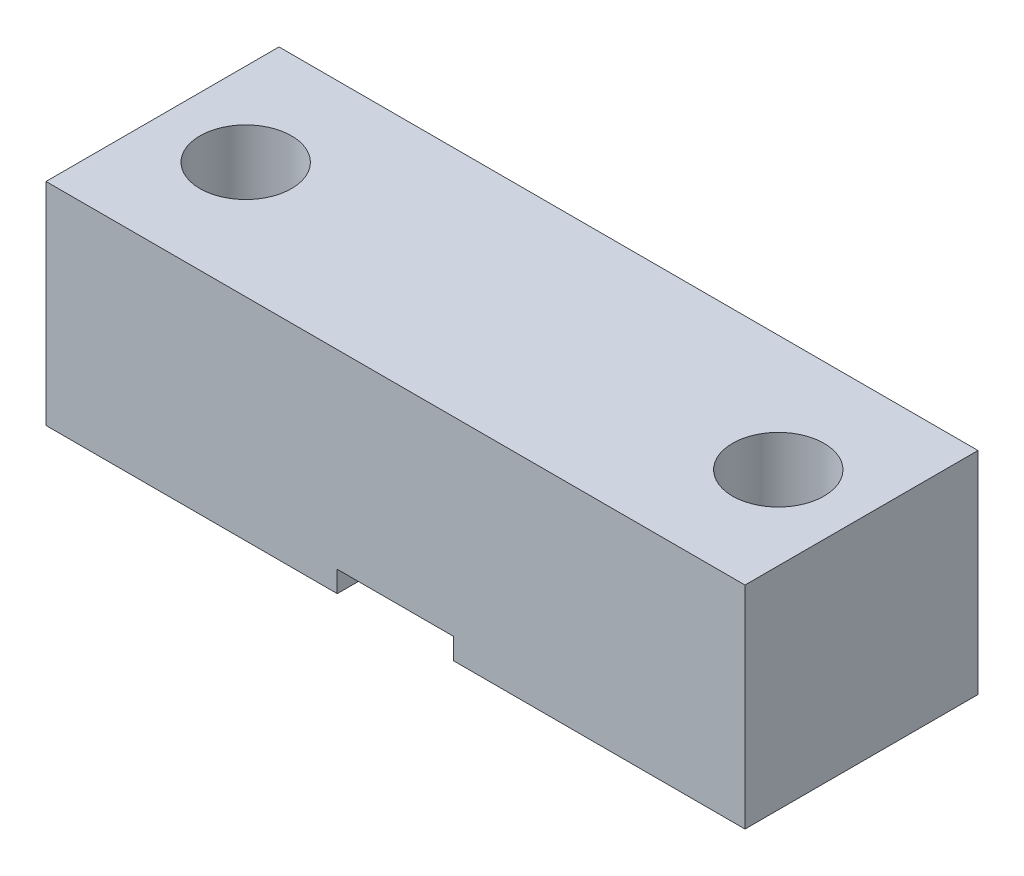
ISO-10303-21;
HEADER;
FILE_DESCRIPTION(('STEP AP214'),'2;1');
FILE_NAME('part.step','',(''),(''),'','','');
FILE_SCHEMA(('AUTOMOTIVE_DESIGN { 1 0 10303 214 1 1 1 1 }'));
ENDSEC;
DATA;
#1=APPLICATION_CONTEXT('core data for automotive mechanical design processes');
#2=APPLICATION_PROTOCOL_DEFINITION('international standard','automotive_design',2000,#1);
#3=PRODUCT_CONTEXT('',#1,'mechanical');
#4=PRODUCT('Part','Part','',(#3));
#5=PRODUCT_RELATED_PRODUCT_CATEGORY('part','',(#4));
#6=PRODUCT_DEFINITION_FORMATION('','',#4);
#7=PRODUCT_DEFINITION_CONTEXT('part definition',#1,'design');
#8=PRODUCT_DEFINITION('design','',#6,#7);
#9=PRODUCT_DEFINITION_SHAPE('','',#8);
#10=(LENGTH_UNIT() NAMED_UNIT(*) SI_UNIT(.MILLI.,.METRE.));
#11=(NAMED_UNIT(*) PLANE_ANGLE_UNIT() SI_UNIT($,.RADIAN.));
#12=(NAMED_UNIT(*) SI_UNIT($,.STERADIAN.) SOLID_ANGLE_UNIT());
#13=UNCERTAINTY_MEASURE_WITH_UNIT(LENGTH_MEASURE(1.E-05),#10,'distance_accuracy_value','');
#14=(GEOMETRIC_REPRESENTATION_CONTEXT(3) GLOBAL_UNCERTAINTY_ASSIGNED_CONTEXT((#13)) GLOBAL_UNIT_ASSIGNED_CONTEXT((#10,
#11,#12)) REPRESENTATION_CONTEXT('',''));
#15=CARTESIAN_POINT('',(0.,0.,0.));
#16=DIRECTION('',(0.,0.,1.));
#17=DIRECTION('',(1.,0.,0.));
#18=AXIS2_PLACEMENT_3D('',#15,#16,#17);
#19=CARTESIAN_POINT('',(0.,0.,0.));
#20=DIRECTION('',(0.,1.,0.));
#21=DIRECTION('',(0.,0.,1.));
#22=AXIS2_PLACEMENT_3D('',#19,#20,#21);
#23=PLANE('',#22);
#24=CARTESIAN_POINT('',(-16.,0.,0.));
#25=DIRECTION('',(0.,1.,0.));
#26=DIRECTION('',(0.,0.,1.));
#27=AXIS2_PLACEMENT_3D('',#24,#25,#26);
#28=CIRCLE('',#27,2.75);
#29=CARTESIAN_POINT('',(-16.,0.,2.75));
#30=VERTEX_POINT('',#29);
#31=EDGE_CURVE('E165',#30,#30,#28,.T.);
#32=ORIENTED_EDGE('',*,*,#31,.T.);
#33=EDGE_LOOP('',(#32));
#34=FACE_BOUND('',#33,.T.);
#35=DIRECTION('',(-1.,0.,0.));
#36=VECTOR('',#35,1.);
#37=CARTESIAN_POINT('',(-21.,0.,-7.00000000000001));
#38=LINE('',#37,#36);
#39=CARTESIAN_POINT('',(-3.5,0.,-7.00000000000001));
#40=VERTEX_POINT('',#39);
#41=CARTESIAN_POINT('',(-21.,0.,-7.00000000000001));
#42=VERTEX_POINT('',#41);
#43=EDGE_CURVE('E79',#40,#42,#38,.T.);
#44=ORIENTED_EDGE('',*,*,#43,.F.);
#45=DIRECTION('',(0.,0.,1.));
#46=VECTOR('',#45,1.);
#47=CARTESIAN_POINT('',(-3.5,0.,-14.1142743832383));
#48=LINE('',#47,#46);
#49=CARTESIAN_POINT('',(-3.5,0.,6.99999999999999));
#50=VERTEX_POINT('',#49);
#51=EDGE_CURVE('E110',#40,#50,#48,.T.);
#52=ORIENTED_EDGE('',*,*,#51,.T.);
#53=DIRECTION('',(1.,0.,0.));
#54=VECTOR('',#53,1.);
#55=CARTESIAN_POINT('',(-21.,0.,6.99999999999999));
#56=LINE('',#55,#54);
#57=CARTESIAN_POINT('',(-21.,0.,6.99999999999999));
#58=VERTEX_POINT('',#57);
#59=EDGE_CURVE('E120',#58,#50,#56,.T.);
#60=ORIENTED_EDGE('',*,*,#59,.F.);
#61=DIRECTION('',(0.,0.,1.));
#62=VECTOR('',#61,1.);
#63=CARTESIAN_POINT('',(-21.,0.,-7.00000000000001));
#64=LINE('',#63,#62);
#65=EDGE_CURVE('E131',#42,#58,#64,.T.);
#66=ORIENTED_EDGE('',*,*,#65,.F.);
#67=EDGE_LOOP('',(#44,#52,#60,#66));
#68=FACE_BOUND('',#67,.T.);
#69=ADVANCED_FACE('F34',(#34,#68),#23,.F.);
#70=CARTESIAN_POINT('',(0.,12.7,0.));
#71=DIRECTION('',(0.,1.,0.));
#72=DIRECTION('',(0.,0.,1.));
#73=AXIS2_PLACEMENT_3D('',#70,#71,#72);
#74=PLANE('',#73);
#75=CARTESIAN_POINT('',(-16.,12.7,0.));
#76=DIRECTION('',(0.,1.,0.));
#77=DIRECTION('',(0.,0.,1.));
#78=AXIS2_PLACEMENT_3D('',#75,#76,#77);
#79=CIRCLE('',#78,2.75);
#80=CARTESIAN_POINT('',(-16.,12.7,2.75));
#81=VERTEX_POINT('',#80);
#82=EDGE_CURVE('E168',#81,#81,#79,.T.);
#83=ORIENTED_EDGE('',*,*,#82,.F.);
#84=EDGE_LOOP('',(#83));
#85=FACE_BOUND('',#84,.T.);
#86=DIRECTION('',(0.,0.,1.));
#87=VECTOR('',#86,1.);
#88=CARTESIAN_POINT('',(-21.,12.7,-7.00000000000001));
#89=LINE('',#88,#87);
#90=CARTESIAN_POINT('',(-21.,12.7,-7.00000000000001));
#91=VERTEX_POINT('',#90);
#92=CARTESIAN_POINT('',(-21.,12.7,6.99999999999999));
#93=VERTEX_POINT('',#92);
#94=EDGE_CURVE('E138',#91,#93,#89,.T.);
#95=ORIENTED_EDGE('',*,*,#94,.T.);
#96=DIRECTION('',(1.,0.,0.));
#97=VECTOR('',#96,1.);
#98=CARTESIAN_POINT('',(-21.,12.7,6.99999999999999));
#99=LINE('',#98,#97);
#100=CARTESIAN_POINT('',(21.,12.7,6.99999999999999));
#101=VERTEX_POINT('',#100);
#102=EDGE_CURVE('E86',#93,#101,#99,.T.);
#103=ORIENTED_EDGE('',*,*,#102,.T.);
#104=DIRECTION('',(0.,0.,-1.));
#105=VECTOR('',#104,1.);
#106=CARTESIAN_POINT('',(21.,12.7,-7.00000000000001));
#107=LINE('',#106,#105);
#108=CARTESIAN_POINT('',(21.,12.7,-7.00000000000001));
#109=VERTEX_POINT('',#108);
#110=EDGE_CURVE('E149',#101,#109,#107,.T.);
#111=ORIENTED_EDGE('',*,*,#110,.T.);
#112=DIRECTION('',(-1.,0.,0.));
#113=VECTOR('',#112,1.);
#114=CARTESIAN_POINT('',(-21.,12.7,-7.00000000000001));
#115=LINE('',#114,#113);
#116=EDGE_CURVE('E58',#109,#91,#115,.T.);
#117=ORIENTED_EDGE('',*,*,#116,.T.);
#118=EDGE_LOOP('',(#95,#103,#111,#117));
#119=FACE_BOUND('',#118,.T.);
#120=CARTESIAN_POINT('',(16.,12.7,0.));
#121=DIRECTION('',(0.,1.,0.));
#122=DIRECTION('',(0.,0.,1.));
#123=AXIS2_PLACEMENT_3D('',#120,#121,#122);
#124=CIRCLE('',#123,2.75);
#125=CARTESIAN_POINT('',(16.,12.7,2.75));
#126=VERTEX_POINT('',#125);
#127=EDGE_CURVE('E169',#126,#126,#124,.T.);
#128=ORIENTED_EDGE('',*,*,#127,.F.);
#129=EDGE_LOOP('',(#128));
#130=FACE_BOUND('',#129,.T.);
#131=ADVANCED_FACE('F200',(#85,#119,#130),#74,.T.);
#132=CARTESIAN_POINT('',(3.5,0.,6.99999999999999));
#133=VERTEX_POINT('',#132);
#134=CARTESIAN_POINT('',(21.,0.,6.99999999999999));
#135=VERTEX_POINT('',#134);
#136=EDGE_CURVE('E128',#133,#135,#56,.T.);
#137=ORIENTED_EDGE('',*,*,#136,.F.);
#138=DIRECTION('',(0.,0.,1.));
#139=VECTOR('',#138,1.);
#140=CARTESIAN_POINT('',(3.5,0.,-14.1142743832383));
#141=LINE('',#140,#139);
#142=CARTESIAN_POINT('',(3.5,0.,-7.00000000000001));
#143=VERTEX_POINT('',#142);
#144=EDGE_CURVE('E121',#143,#133,#141,.T.);
#145=ORIENTED_EDGE('',*,*,#144,.F.);
#146=CARTESIAN_POINT('',(21.,0.,-7.00000000000001));
#147=VERTEX_POINT('',#146);
#148=EDGE_CURVE('E135',#147,#143,#38,.T.);
#149=ORIENTED_EDGE('',*,*,#148,.F.);
#150=DIRECTION('',(0.,0.,-1.));
#151=VECTOR('',#150,1.);
#152=CARTESIAN_POINT('',(21.,0.,-7.00000000000001));
#153=LINE('',#152,#151);
#154=EDGE_CURVE('E127',#135,#147,#153,.T.);
#155=ORIENTED_EDGE('',*,*,#154,.F.);
#156=EDGE_LOOP('',(#137,#145,#149,#155));
#157=FACE_BOUND('',#156,.T.);
#158=CARTESIAN_POINT('',(16.,0.,0.));
#159=DIRECTION('',(0.,1.,0.));
#160=DIRECTION('',(0.,0.,1.));
#161=AXIS2_PLACEMENT_3D('',#158,#159,#160);
#162=CIRCLE('',#161,2.75);
#163=CARTESIAN_POINT('',(16.,0.,2.75));
#164=VERTEX_POINT('',#163);
#165=EDGE_CURVE('E172',#164,#164,#162,.T.);
#166=ORIENTED_EDGE('',*,*,#165,.T.);
#167=EDGE_LOOP('',(#166));
#168=FACE_BOUND('',#167,.T.);
#169=ADVANCED_FACE('F153',(#157,#168),#23,.F.);
#170=CARTESIAN_POINT('',(-21.,12.7,-7.00000000000001));
#171=DIRECTION('',(1.,0.,0.));
#172=DIRECTION('',(0.,0.,-1.));
#173=AXIS2_PLACEMENT_3D('',#170,#171,#172);
#174=PLANE('',#173);
#175=ORIENTED_EDGE('',*,*,#65,.T.);
#176=DIRECTION('',(0.,-1.,0.));
#177=VECTOR('',#176,1.);
#178=CARTESIAN_POINT('',(-21.,12.7,6.99999999999999));
#179=LINE('',#178,#177);
#180=EDGE_CURVE('E11',#93,#58,#179,.T.);
#181=ORIENTED_EDGE('',*,*,#180,.F.);
#182=ORIENTED_EDGE('',*,*,#94,.F.);
#183=DIRECTION('',(0.,-1.,0.));
#184=VECTOR('',#183,1.);
#185=CARTESIAN_POINT('',(-21.,12.7,-7.00000000000001));
#186=LINE('',#185,#184);
#187=EDGE_CURVE('E139',#91,#42,#186,.T.);
#188=ORIENTED_EDGE('',*,*,#187,.T.);
#189=EDGE_LOOP('',(#175,#181,#182,#188));
#190=FACE_BOUND('',#189,.T.);
#191=ADVANCED_FACE('F36',(#190),#174,.F.);
#192=CARTESIAN_POINT('',(-21.,12.7,6.99999999999999));
#193=DIRECTION('',(0.,0.,-1.));
#194=DIRECTION('',(-1.,0.,0.));
#195=AXIS2_PLACEMENT_3D('',#192,#193,#194);
#196=PLANE('',#195);
#197=ORIENTED_EDGE('',*,*,#59,.T.);
#198=DIRECTION('',(0.,-1.,0.));
#199=VECTOR('',#198,1.);
#200=CARTESIAN_POINT('',(-3.5,1.27,6.99999999999999));
#201=LINE('',#200,#199);
#202=CARTESIAN_POINT('',(-3.5,1.27,6.99999999999999));
#203=VERTEX_POINT('',#202);
#204=EDGE_CURVE('E107',#203,#50,#201,.T.);
#205=ORIENTED_EDGE('',*,*,#204,.F.);
#206=DIRECTION('',(-1.,0.,0.));
#207=VECTOR('',#206,1.);
#208=CARTESIAN_POINT('',(-3.5,1.27,6.99999999999999));
#209=LINE('',#208,#207);
#210=CARTESIAN_POINT('',(3.5,1.27,6.99999999999999));
#211=VERTEX_POINT('',#210);
#212=EDGE_CURVE('E122',#211,#203,#209,.T.);
#213=ORIENTED_EDGE('',*,*,#212,.F.);
#214=DIRECTION('',(0.,1.,0.));
#215=VECTOR('',#214,1.);
#216=CARTESIAN_POINT('',(3.5,1.27,6.99999999999999));
#217=LINE('',#216,#215);
#218=EDGE_CURVE('E116',#133,#211,#217,.T.);
#219=ORIENTED_EDGE('',*,*,#218,.F.);
#220=ORIENTED_EDGE('',*,*,#136,.T.);
#221=DIRECTION('',(0.,-1.,0.));
#222=VECTOR('',#221,1.);
#223=CARTESIAN_POINT('',(21.,12.7,6.99999999999999));
#224=LINE('',#223,#222);
#225=EDGE_CURVE('E42',#101,#135,#224,.T.);
#226=ORIENTED_EDGE('',*,*,#225,.F.);
#227=ORIENTED_EDGE('',*,*,#102,.F.);
#228=ORIENTED_EDGE('',*,*,#180,.T.);
#229=EDGE_LOOP('',(#197,#205,#213,#219,#220,#226,#227,#228));
#230=FACE_BOUND('',#229,.T.);
#231=ADVANCED_FACE('F124',(#230),#196,.F.);
#232=CARTESIAN_POINT('',(21.,12.7,-7.00000000000001));
#233=DIRECTION('',(-1.,0.,0.));
#234=DIRECTION('',(0.,0.,1.));
#235=AXIS2_PLACEMENT_3D('',#232,#233,#234);
#236=PLANE('',#235);
#237=ORIENTED_EDGE('',*,*,#154,.T.);
#238=DIRECTION('',(0.,-1.,0.));
#239=VECTOR('',#238,1.);
#240=CARTESIAN_POINT('',(21.,12.7,-7.00000000000001));
#241=LINE('',#240,#239);
#242=EDGE_CURVE('E141',#109,#147,#241,.T.);
#243=ORIENTED_EDGE('',*,*,#242,.F.);
#244=ORIENTED_EDGE('',*,*,#110,.F.);
#245=ORIENTED_EDGE('',*,*,#225,.T.);
#246=EDGE_LOOP('',(#237,#243,#244,#245));
#247=FACE_BOUND('',#246,.T.);
#248=ADVANCED_FACE('F147',(#247),#236,.F.);
#249=CARTESIAN_POINT('',(-21.,12.7,-7.00000000000001));
#250=DIRECTION('',(0.,0.,1.));
#251=DIRECTION('',(1.,0.,0.));
#252=AXIS2_PLACEMENT_3D('',#249,#250,#251);
#253=PLANE('',#252);
#254=DIRECTION('',(1.,0.,0.));
#255=VECTOR('',#254,1.);
#256=CARTESIAN_POINT('',(-3.5,1.27,-7.00000000000001));
#257=LINE('',#256,#255);
#258=CARTESIAN_POINT('',(-3.5,1.27,-7.00000000000001));
#259=VERTEX_POINT('',#258);
#260=CARTESIAN_POINT('',(3.5,1.27,-7.00000000000001));
#261=VERTEX_POINT('',#260);
#262=EDGE_CURVE('E184',#259,#261,#257,.T.);
#263=ORIENTED_EDGE('',*,*,#262,.F.);
#264=DIRECTION('',(0.,1.,0.));
#265=VECTOR('',#264,1.);
#266=CARTESIAN_POINT('',(-3.5,1.27,-7.00000000000001));
#267=LINE('',#266,#265);
#268=EDGE_CURVE('E175',#40,#259,#267,.T.);
#269=ORIENTED_EDGE('',*,*,#268,.F.);
#270=ORIENTED_EDGE('',*,*,#43,.T.);
#271=ORIENTED_EDGE('',*,*,#187,.F.);
#272=ORIENTED_EDGE('',*,*,#116,.F.);
#273=ORIENTED_EDGE('',*,*,#242,.T.);
#274=ORIENTED_EDGE('',*,*,#148,.T.);
#275=DIRECTION('',(0.,-1.,0.));
#276=VECTOR('',#275,1.);
#277=CARTESIAN_POINT('',(3.5,1.27,-7.00000000000001));
#278=LINE('',#277,#276);
#279=EDGE_CURVE('E159',#261,#143,#278,.T.);
#280=ORIENTED_EDGE('',*,*,#279,.F.);
#281=EDGE_LOOP('',(#263,#269,#270,#271,#272,#273,#274,#280));
#282=FACE_BOUND('',#281,.T.);
#283=ADVANCED_FACE('F158',(#282),#253,.F.);
#284=CARTESIAN_POINT('',(-16.,12.7,0.));
#285=DIRECTION('',(0.,-1.,0.));
#286=DIRECTION('',(0.,0.,-1.));
#287=AXIS2_PLACEMENT_3D('',#284,#285,#286);
#288=CYLINDRICAL_SURFACE('',#287,2.75);
#289=ORIENTED_EDGE('',*,*,#82,.T.);
#290=EDGE_LOOP('',(#289));
#291=FACE_BOUND('',#290,.T.);
#292=ORIENTED_EDGE('',*,*,#31,.F.);
#293=EDGE_LOOP('',(#292));
#294=FACE_BOUND('',#293,.T.);
#295=ADVANCED_FACE('F222',(#291,#294),#288,.F.);
#296=CARTESIAN_POINT('',(16.,12.7,0.));
#297=DIRECTION('',(0.,-1.,0.));
#298=DIRECTION('',(0.,0.,-1.));
#299=AXIS2_PLACEMENT_3D('',#296,#297,#298);
#300=CYLINDRICAL_SURFACE('',#299,2.75);
#301=ORIENTED_EDGE('',*,*,#127,.T.);
#302=EDGE_LOOP('',(#301));
#303=FACE_BOUND('',#302,.T.);
#304=ORIENTED_EDGE('',*,*,#165,.F.);
#305=EDGE_LOOP('',(#304));
#306=FACE_BOUND('',#305,.T.);
#307=ADVANCED_FACE('F197',(#303,#306),#300,.F.);
#308=CARTESIAN_POINT('',(-3.5,1.27,-14.1142743832383));
#309=DIRECTION('',(-1.,0.,0.));
#310=DIRECTION('',(0.,-1.,0.));
#311=AXIS2_PLACEMENT_3D('',#308,#309,#310);
#312=PLANE('',#311);
#313=ORIENTED_EDGE('',*,*,#268,.T.);
#314=DIRECTION('',(0.,0.,1.));
#315=VECTOR('',#314,1.);
#316=CARTESIAN_POINT('',(-3.5,1.27,-14.1142743832383));
#317=LINE('',#316,#315);
#318=EDGE_CURVE('E112',#259,#203,#317,.T.);
#319=ORIENTED_EDGE('',*,*,#318,.T.);
#320=ORIENTED_EDGE('',*,*,#204,.T.);
#321=ORIENTED_EDGE('',*,*,#51,.F.);
#322=EDGE_LOOP('',(#313,#319,#320,#321));
#323=FACE_BOUND('',#322,.T.);
#324=ADVANCED_FACE('F109',(#323),#312,.F.);
#325=CARTESIAN_POINT('',(-3.5,1.27,-14.1142743832383));
#326=DIRECTION('',(0.,1.,0.));
#327=DIRECTION('',(-1.,0.,0.));
#328=AXIS2_PLACEMENT_3D('',#325,#326,#327);
#329=PLANE('',#328);
#330=ORIENTED_EDGE('',*,*,#262,.T.);
#331=DIRECTION('',(0.,0.,1.));
#332=VECTOR('',#331,1.);
#333=CARTESIAN_POINT('',(3.5,1.27,-14.1142743832383));
#334=LINE('',#333,#332);
#335=EDGE_CURVE('E49',#261,#211,#334,.T.);
#336=ORIENTED_EDGE('',*,*,#335,.T.);
#337=ORIENTED_EDGE('',*,*,#212,.T.);
#338=ORIENTED_EDGE('',*,*,#318,.F.);
#339=EDGE_LOOP('',(#330,#336,#337,#338));
#340=FACE_BOUND('',#339,.T.);
#341=ADVANCED_FACE('F189',(#340),#329,.F.);
#342=CARTESIAN_POINT('',(3.5,1.27,-14.1142743832383));
#343=DIRECTION('',(1.,0.,0.));
#344=DIRECTION('',(0.,1.,0.));
#345=AXIS2_PLACEMENT_3D('',#342,#343,#344);
#346=PLANE('',#345);
#347=ORIENTED_EDGE('',*,*,#279,.T.);
#348=ORIENTED_EDGE('',*,*,#144,.T.);
#349=ORIENTED_EDGE('',*,*,#218,.T.);
#350=ORIENTED_EDGE('',*,*,#335,.F.);
#351=EDGE_LOOP('',(#347,#348,#349,#350));
#352=FACE_BOUND('',#351,.T.);
#353=ADVANCED_FACE('F186',(#352),#346,.F.);
#354=CLOSED_SHELL('',(#69,#131,#169,#191,#231,#248,#283,#295,#307,#324,#341,#353));
#355=MANIFOLD_SOLID_BREP('B2',#354);
#356=ADVANCED_BREP_SHAPE_REPRESENTATION('',(#18,#355),#14);
#357=SHAPE_DEFINITION_REPRESENTATION(#9,#356);
ENDSEC;
END-ISO-10303-21;
